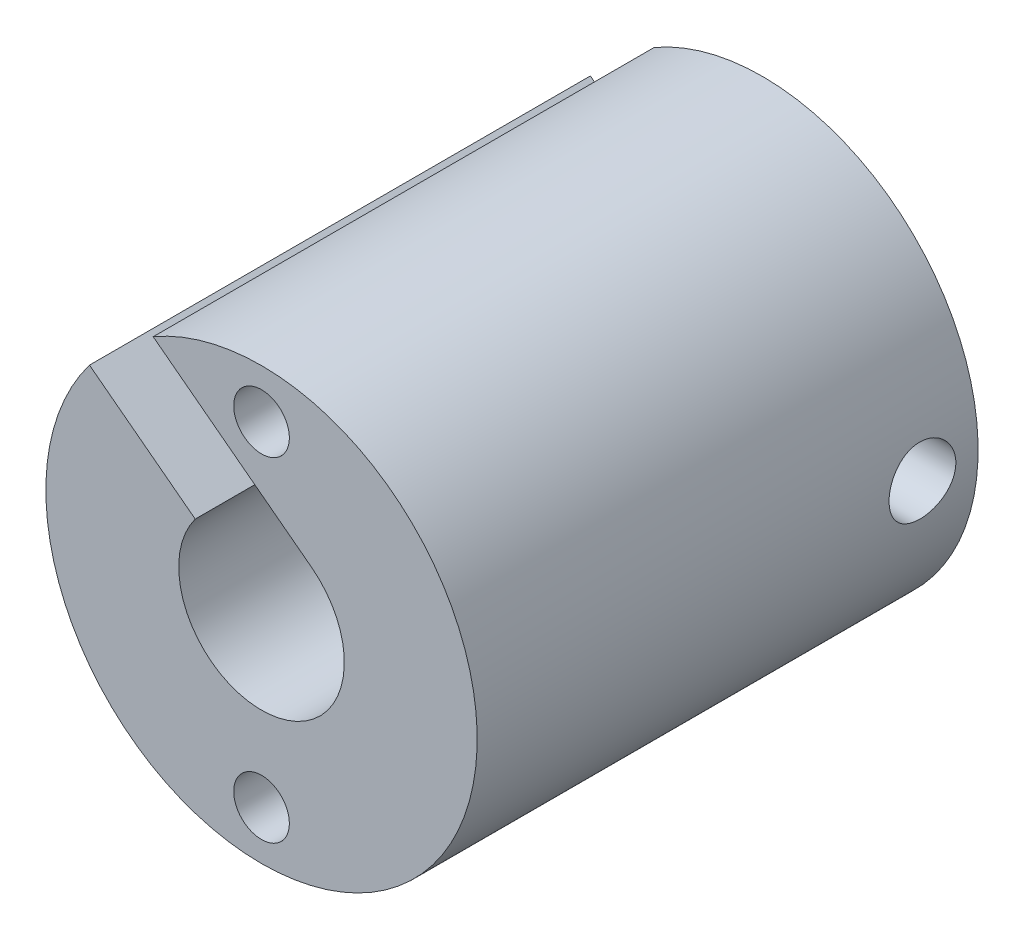
ISO-10303-21;
HEADER;
FILE_DESCRIPTION(('STEP AP214'),'2;1');
FILE_NAME('part.step','',(''),(''),'','','');
FILE_SCHEMA(('AUTOMOTIVE_DESIGN { 1 0 10303 214 1 1 1 1 }'));
ENDSEC;
DATA;
#1=APPLICATION_CONTEXT('core data for automotive mechanical design processes');
#2=APPLICATION_PROTOCOL_DEFINITION('international standard','automotive_design',2000,#1);
#3=PRODUCT_CONTEXT('',#1,'mechanical');
#4=PRODUCT('Part','Part','',(#3));
#5=PRODUCT_RELATED_PRODUCT_CATEGORY('part','',(#4));
#6=PRODUCT_DEFINITION_FORMATION('','',#4);
#7=PRODUCT_DEFINITION_CONTEXT('part definition',#1,'design');
#8=PRODUCT_DEFINITION('design','',#6,#7);
#9=PRODUCT_DEFINITION_SHAPE('','',#8);
#10=(LENGTH_UNIT() NAMED_UNIT(*) SI_UNIT(.MILLI.,.METRE.));
#11=(NAMED_UNIT(*) PLANE_ANGLE_UNIT() SI_UNIT($,.RADIAN.));
#12=(NAMED_UNIT(*) SI_UNIT($,.STERADIAN.) SOLID_ANGLE_UNIT());
#13=UNCERTAINTY_MEASURE_WITH_UNIT(LENGTH_MEASURE(1.E-05),#10,'distance_accuracy_value','');
#14=(GEOMETRIC_REPRESENTATION_CONTEXT(3) GLOBAL_UNCERTAINTY_ASSIGNED_CONTEXT((#13)) GLOBAL_UNIT_ASSIGNED_CONTEXT((#10,
#11,#12)) REPRESENTATION_CONTEXT('',''));
#15=CARTESIAN_POINT('',(0.,0.,0.));
#16=DIRECTION('',(0.,0.,1.));
#17=DIRECTION('',(1.,0.,0.));
#18=AXIS2_PLACEMENT_3D('',#15,#16,#17);
#19=CARTESIAN_POINT('',(0.,0.,18.));
#20=DIRECTION('',(0.,0.,-1.));
#21=DIRECTION('',(-1.,0.,0.));
#22=AXIS2_PLACEMENT_3D('',#19,#20,#21);
#23=CYLINDRICAL_SURFACE('',#22,2.975);
#24=CARTESIAN_POINT('',(-2.975,0.,3.2));
#25=CARTESIAN_POINT('',(-2.97499543849122,-0.0644527119775091,3.19999385413996));
#26=CARTESIAN_POINT('',(-2.97288096223465,-0.129015279752243,3.19477635476633));
#27=CARTESIAN_POINT('',(-2.96462844372845,-0.256318568293996,3.17408791318256));
#28=CARTESIAN_POINT('',(-2.95847954882213,-0.319053897009307,3.15858931338891));
#29=CARTESIAN_POINT('',(-2.94282045448793,-0.440655468210577,3.11799623089266));
#30=CARTESIAN_POINT('',(-2.93332134513576,-0.499533725193222,3.0929333861323));
#31=CARTESIAN_POINT('',(-2.91189528803918,-0.612195786829669,3.03404980370043));
#32=CARTESIAN_POINT('',(-2.89996916185444,-0.665981306401732,3.00023202857368));
#33=CARTESIAN_POINT('',(-2.87425599929314,-0.76957748673358,2.92309282469788));
#34=CARTESIAN_POINT('',(-2.8604105582516,-0.819113231125393,2.87942180106688));
#35=CARTESIAN_POINT('',(-2.83268306663957,-0.910391028104634,2.78455386581631));
#36=CARTESIAN_POINT('',(-2.81880100134134,-0.952129211188402,2.73335324007048));
#37=CARTESIAN_POINT('',(-2.79186996206152,-1.02849565515845,2.62205589091495));
#38=CARTESIAN_POINT('',(-2.77888748046482,-1.06271480038636,2.56166070202098));
#39=CARTESIAN_POINT('',(-2.75614374843864,-1.12038604250686,2.43537024792903));
#40=CARTESIAN_POINT('',(-2.74638094287695,-1.14384333961584,2.36947765735255));
#41=CARTESIAN_POINT('',(-2.73180997754027,-1.17820847725778,2.23722308431733));
#42=CARTESIAN_POINT('',(-2.72679485252911,-1.18964321331572,2.17102165548088));
#43=CARTESIAN_POINT('',(-2.72168809208222,-1.20128413773127,2.03746433213749));
#44=CARTESIAN_POINT('',(-2.72159397883171,-1.20149597701278,1.97010903571399));
#45=CARTESIAN_POINT('',(-2.72616359839092,-1.19108390567823,1.84125527563815));
#46=CARTESIAN_POINT('',(-2.73049008440479,-1.18122806989877,1.7796804478425));
#47=CARTESIAN_POINT('',(-2.74284660745854,-1.15224262138067,1.65914708892409));
#48=CARTESIAN_POINT('',(-2.75087730288875,-1.13311135998664,1.6001890249509));
#49=CARTESIAN_POINT('',(-2.76991482721115,-1.08575194255988,1.48512669561937));
#50=CARTESIAN_POINT('',(-2.78097953807692,-1.05734456705247,1.42910620107402));
#51=CARTESIAN_POINT('',(-2.80482295442844,-0.99236529364564,1.32241893360982));
#52=CARTESIAN_POINT('',(-2.81760230965147,-0.955790297248351,1.27175420324848));
#53=CARTESIAN_POINT('',(-2.84466016856605,-0.872130415296309,1.17301922481323));
#54=CARTESIAN_POINT('',(-2.85897749101233,-0.824444816398094,1.12546722939973));
#55=CARTESIAN_POINT('',(-2.88664402412407,-0.721625493753537,1.03886760606024));
#56=CARTESIAN_POINT('',(-2.89999303507381,-0.666490240179465,0.999821729226339));
#57=CARTESIAN_POINT('',(-2.92456354148567,-0.548845901752929,0.930646962195982));
#58=CARTESIAN_POINT('',(-2.93573609074813,-0.486209355852531,0.900716186793777));
#59=CARTESIAN_POINT('',(-2.95432368810416,-0.356225100487437,0.851995626741149));
#60=CARTESIAN_POINT('',(-2.96174067803455,-0.288879846234951,0.833200083688499));
#61=CARTESIAN_POINT('',(-2.97162579476467,-0.155731333869113,0.808338911550859));
#62=CARTESIAN_POINT('',(-2.9743642083898,-0.0900780894675279,0.801577006546156));
#63=CARTESIAN_POINT('',(-2.97543728704671,0.0414759594095336,0.798915161746905));
#64=CARTESIAN_POINT('',(-2.9737731174481,0.107376693762895,0.803012347537128));
#65=CARTESIAN_POINT('',(-2.96640464064649,0.234378330486649,0.821443032014926));
#66=CARTESIAN_POINT('',(-2.96088909177758,0.295560761342413,0.835298533027038));
#67=CARTESIAN_POINT('',(-2.94656947103641,0.414673939099446,0.87219919418572));
#68=CARTESIAN_POINT('',(-2.93776497795531,0.472604268416699,0.895245531410817));
#69=CARTESIAN_POINT('',(-2.91738380641617,0.585571463709733,0.950626382746522));
#70=CARTESIAN_POINT('',(-2.90573030783273,0.640464866393299,0.983224365920433));
#71=CARTESIAN_POINT('',(-2.88091068758872,0.744196100744338,1.05649146876159));
#72=CARTESIAN_POINT('',(-2.86774395507497,0.793031470283575,1.09716385270736));
#73=CARTESIAN_POINT('',(-2.84023398349683,0.886700071506095,1.18862499331149));
#74=CARTESIAN_POINT('',(-2.82587109109581,0.931044735884626,1.23990949968686));
#75=CARTESIAN_POINT('',(-2.79840050433673,1.01062182247356,1.34944136737322));
#76=CARTESIAN_POINT('',(-2.78529303180963,1.04585263614281,1.40768995515474));
#77=CARTESIAN_POINT('',(-2.76178494841692,1.10645452319749,1.53043700991597));
#78=CARTESIAN_POINT('',(-2.75141435029038,1.13171766764747,1.59499492394022));
#79=CARTESIAN_POINT('',(-2.73500923242151,1.17081490709715,1.72799417948904));
#80=CARTESIAN_POINT('',(-2.72897143909873,1.18465763179588,1.79643254692539));
#81=CARTESIAN_POINT('',(-2.72239415005224,1.1996900340859,1.92986734333339));
#82=CARTESIAN_POINT('',(-2.72148551167536,1.20172948342536,1.99475040756161));
#83=CARTESIAN_POINT('',(-2.72429959742431,1.19533633659155,2.12388961487603));
#84=CARTESIAN_POINT('',(-2.72802171074472,1.18690512152014,2.18814583951701));
#85=CARTESIAN_POINT('',(-2.73934989711425,1.16050804432101,2.31151206112791));
#86=CARTESIAN_POINT('',(-2.74679092289663,1.14294617234084,2.37072505121852));
#87=CARTESIAN_POINT('',(-2.76459963700392,1.09916758385867,2.48538586777053));
#88=CARTESIAN_POINT('',(-2.7749681364265,1.07294846840415,2.54083264546064));
#89=CARTESIAN_POINT('',(-2.79820830030691,1.01084794461784,2.64988353222506));
#90=CARTESIAN_POINT('',(-2.81119008670959,0.974495250483417,2.70319539921164));
#91=CARTESIAN_POINT('',(-2.83786414760872,0.893842582107171,2.80322875913718));
#92=CARTESIAN_POINT('',(-2.85155664187023,0.849540139113237,2.8499481967584));
#93=CARTESIAN_POINT('',(-2.87920209513429,0.75074566049415,2.93865554113822));
#94=CARTESIAN_POINT('',(-2.89311197831313,0.695772360789644,2.98012328293469));
#95=CARTESIAN_POINT('',(-2.91869874380594,0.579122193902362,3.05325908930909));
#96=CARTESIAN_POINT('',(-2.93037459209967,0.51744224316807,3.08492262019209));
#97=CARTESIAN_POINT('',(-2.949985457956,0.390228963102568,3.13681869640491));
#98=CARTESIAN_POINT('',(-2.95798488324745,0.324786549753689,3.15724939298633));
#99=CARTESIAN_POINT('',(-2.9696057567389,0.191129522551541,3.18664282997894));
#100=CARTESIAN_POINT('',(-2.9732410600885,0.122924396448249,3.19564186876941));
#101=CARTESIAN_POINT('',(-2.97483453061162,0.0363702112733114,3.1995884109585));
#102=CARTESIAN_POINT('',(-2.97500128732325,0.018189480365881,3.20000173444991));
#103=CARTESIAN_POINT('',(-2.975,0.,3.2));
#104=B_SPLINE_CURVE_WITH_KNOTS('',3,(#24,#25,#26,#27,#28,#29,#30,#31,#32,#33,#34,#35,#36,#37,
#38,#39,#40,#41,#42,#43,#44,#45,#46,#47,#48,#49,#50,#51,#52,#53,#54,#55,#56,#57,#58,#59,#60,#61,
#62,#63,#64,#65,#66,#67,#68,#69,#70,#71,#72,#73,#74,#75,#76,#77,#78,#79,#80,#81,#82,#83,#84,#85,
#86,#87,#88,#89,#90,#91,#92,#93,#94,#95,#96,#97,#98,#99,#100,#101,#102,#103),.UNSPECIFIED.,.T.,
.F.,(4,2,2,2,2,2,2,2,2,2,2,2,2,2,2,2,2,2,2,2,2,2,2,2,2,2,2,2,2,2,2,2,2,2,2,2,2,2,2,4),(0.,
0.193308895182854,0.387139938452418,0.580335281736046,0.773465335700886,0.975001776195977,
1.1766379640907,1.38743391226422,1.59812789448604,1.79914503300019,2.00006095492309,
2.18671548188243,2.37340319781721,2.56393537723301,2.7545399607814,2.96014990840093,
3.16580214351393,3.37564888068033,3.58538700411907,3.78253793589659,3.97963668678249,
4.16769753995862,4.35578248599337,4.54964266654468,4.74358138011192,4.95053608193494,
5.1575272851659,5.36670199957354,5.57571850854893,5.76947942327626,5.96321478326027,
6.14902789689213,6.33489254326157,6.53151135611131,6.72819133388798,6.93793099134064,
7.14776749293562,7.35377280989764,7.55912235982234,7.61367690447371),.UNSPECIFIED.);
#105=CARTESIAN_POINT('',(-2.975,0.,3.2));
#106=VERTEX_POINT('',#105);
#107=EDGE_CURVE('E43',#106,#106,#104,.T.);
#108=ORIENTED_EDGE('',*,*,#107,.F.);
#109=EDGE_LOOP('',(#108));
#110=FACE_BOUND('',#109,.T.);
#111=CARTESIAN_POINT('',(2.975,0.,0.8));
#112=CARTESIAN_POINT('',(2.97499543849122,-0.0644527119775091,0.800006145860041));
#113=CARTESIAN_POINT('',(2.97288096223465,-0.129015279752243,0.805223645233673));
#114=CARTESIAN_POINT('',(2.96462844372845,-0.256318568293995,0.82591208681744));
#115=CARTESIAN_POINT('',(2.95847954882213,-0.319053897009307,0.841410686611089));
#116=CARTESIAN_POINT('',(2.94282045448793,-0.440655468210577,0.882003769107338));
#117=CARTESIAN_POINT('',(2.93332134513576,-0.499533725193222,0.907066613867697));
#118=CARTESIAN_POINT('',(2.91189528803918,-0.612195786829669,0.96595019629957));
#119=CARTESIAN_POINT('',(2.89996916185444,-0.665981306401732,0.999767971426318));
#120=CARTESIAN_POINT('',(2.87425599929314,-0.76957748673358,1.07690717530212));
#121=CARTESIAN_POINT('',(2.8604105582516,-0.819113231125392,1.12057819893312));
#122=CARTESIAN_POINT('',(2.83268306663957,-0.910391028104634,1.21544613418369));
#123=CARTESIAN_POINT('',(2.81880100134134,-0.952129211188402,1.26664675992952));
#124=CARTESIAN_POINT('',(2.79186996206152,-1.02849565515845,1.37794410908505));
#125=CARTESIAN_POINT('',(2.77888748046482,-1.06271480038636,1.43833929797902));
#126=CARTESIAN_POINT('',(2.75614374843864,-1.12038604250686,1.56462975207097));
#127=CARTESIAN_POINT('',(2.74638094287695,-1.14384333961584,1.63052234264745));
#128=CARTESIAN_POINT('',(2.73180997754027,-1.17820847725778,1.76277691568267));
#129=CARTESIAN_POINT('',(2.72679485252911,-1.18964321331572,1.82897834451912));
#130=CARTESIAN_POINT('',(2.72168809208222,-1.20128413773127,1.96253566786251));
#131=CARTESIAN_POINT('',(2.72159397883171,-1.20149597701278,2.02989096428601));
#132=CARTESIAN_POINT('',(2.72616359839092,-1.19108390567823,2.15874472436185));
#133=CARTESIAN_POINT('',(2.73049008440479,-1.18122806989877,2.2203195521575));
#134=CARTESIAN_POINT('',(2.74284660745854,-1.15224262138067,2.34085291107591));
#135=CARTESIAN_POINT('',(2.75087730288875,-1.13311135998664,2.3998109750491));
#136=CARTESIAN_POINT('',(2.76991482721115,-1.08575194255988,2.51487330438063));
#137=CARTESIAN_POINT('',(2.78097953807691,-1.05734456705246,2.57089379892598));
#138=CARTESIAN_POINT('',(2.80482295442844,-0.992365293645639,2.67758106639018));
#139=CARTESIAN_POINT('',(2.81760230965147,-0.955790297248351,2.72824579675152));
#140=CARTESIAN_POINT('',(2.84466016856605,-0.872130415296309,2.82698077518677));
#141=CARTESIAN_POINT('',(2.85897749101233,-0.824444816398093,2.87453277060027));
#142=CARTESIAN_POINT('',(2.88664402412407,-0.721625493753536,2.96113239393977));
#143=CARTESIAN_POINT('',(2.89999303507381,-0.666490240179465,3.00017827077366));
#144=CARTESIAN_POINT('',(2.92456354148567,-0.548845901752929,3.06935303780402));
#145=CARTESIAN_POINT('',(2.93573609074813,-0.486209355852531,3.09928381320622));
#146=CARTESIAN_POINT('',(2.95432368810416,-0.356225100487437,3.14800437325885));
#147=CARTESIAN_POINT('',(2.96174067803455,-0.288879846234951,3.1667999163115));
#148=CARTESIAN_POINT('',(2.97162579476467,-0.155731333869113,3.19166108844914));
#149=CARTESIAN_POINT('',(2.9743642083898,-0.0900780894675278,3.19842299345384));
#150=CARTESIAN_POINT('',(2.97543728704671,0.0414759594095337,3.20108483825309));
#151=CARTESIAN_POINT('',(2.9737731174481,0.107376693762895,3.19698765246287));
#152=CARTESIAN_POINT('',(2.96640464064649,0.234378330486649,3.17855696798507));
#153=CARTESIAN_POINT('',(2.96088909177758,0.295560761342413,3.16470146697296));
#154=CARTESIAN_POINT('',(2.94656947103641,0.414673939099447,3.12780080581428));
#155=CARTESIAN_POINT('',(2.93776497795531,0.472604268416699,3.10475446858918));
#156=CARTESIAN_POINT('',(2.91738380641617,0.585571463709733,3.04937361725348));
#157=CARTESIAN_POINT('',(2.90573030783273,0.640464866393299,3.01677563407957));
#158=CARTESIAN_POINT('',(2.88091068758872,0.744196100744338,2.94350853123841));
#159=CARTESIAN_POINT('',(2.86774395507497,0.793031470283575,2.90283614729264));
#160=CARTESIAN_POINT('',(2.84023398349683,0.886700071506095,2.81137500668851));
#161=CARTESIAN_POINT('',(2.82587109109581,0.931044735884626,2.76009050031314));
#162=CARTESIAN_POINT('',(2.79840050433673,1.01062182247356,2.65055863262678));
#163=CARTESIAN_POINT('',(2.78529303180963,1.04585263614281,2.59231004484526));
#164=CARTESIAN_POINT('',(2.76178494841692,1.10645452319749,2.46956299008403));
#165=CARTESIAN_POINT('',(2.75141435029038,1.13171766764747,2.40500507605978));
#166=CARTESIAN_POINT('',(2.73500923242151,1.17081490709715,2.27200582051096));
#167=CARTESIAN_POINT('',(2.72897143909873,1.18465763179588,2.20356745307461));
#168=CARTESIAN_POINT('',(2.72239415005224,1.1996900340859,2.07013265666661));
#169=CARTESIAN_POINT('',(2.72148551167536,1.20172948342536,2.00524959243839));
#170=CARTESIAN_POINT('',(2.72429959742431,1.19533633659155,1.87611038512397));
#171=CARTESIAN_POINT('',(2.72802171074472,1.18690512152014,1.81185416048299));
#172=CARTESIAN_POINT('',(2.73934989711425,1.160508044321,1.68848793887209));
#173=CARTESIAN_POINT('',(2.74679092289663,1.14294617234084,1.62927494878148));
#174=CARTESIAN_POINT('',(2.76459963700391,1.09916758385867,1.51461413222948));
#175=CARTESIAN_POINT('',(2.7749681364265,1.07294846840415,1.45916735453936));
#176=CARTESIAN_POINT('',(2.79820830030691,1.01084794461784,1.35011646777494));
#177=CARTESIAN_POINT('',(2.81119008670959,0.974495250483417,1.29680460078836));
#178=CARTESIAN_POINT('',(2.83786414760872,0.893842582107172,1.19677124086282));
#179=CARTESIAN_POINT('',(2.85155664187023,0.849540139113237,1.1500518032416));
#180=CARTESIAN_POINT('',(2.87920209513429,0.75074566049415,1.06134445886178));
#181=CARTESIAN_POINT('',(2.89311197831313,0.695772360789644,1.01987671706531));
#182=CARTESIAN_POINT('',(2.91869874380594,0.579122193902362,0.946740910690915));
#183=CARTESIAN_POINT('',(2.93037459209967,0.517442243168071,0.915077379807911));
#184=CARTESIAN_POINT('',(2.949985457956,0.390228963102569,0.863181303595089));
#185=CARTESIAN_POINT('',(2.95798488324745,0.32478654975369,0.842750607013667));
#186=CARTESIAN_POINT('',(2.9696057567389,0.191129522551541,0.813357170021057));
#187=CARTESIAN_POINT('',(2.9732410600885,0.122924396448249,0.804358131230596));
#188=CARTESIAN_POINT('',(2.97483453061162,0.0363702112733115,0.800411589041497));
#189=CARTESIAN_POINT('',(2.97500128732325,0.0181894803658809,0.799998265550089));
#190=CARTESIAN_POINT('',(2.975,0.,0.8));
#191=B_SPLINE_CURVE_WITH_KNOTS('',3,(#111,#112,#113,#114,#115,#116,#117,#118,#119,#120,#121,
#122,#123,#124,#125,#126,#127,#128,#129,#130,#131,#132,#133,#134,#135,#136,#137,#138,#139,#140,
#141,#142,#143,#144,#145,#146,#147,#148,#149,#150,#151,#152,#153,#154,#155,#156,#157,#158,#159,
#160,#161,#162,#163,#164,#165,#166,#167,#168,#169,#170,#171,#172,#173,#174,#175,#176,#177,#178,
#179,#180,#181,#182,#183,#184,#185,#186,#187,#188,#189,#190),.UNSPECIFIED.,.T.,.F.,(4,2,2,2,2,2,
2,2,2,2,2,2,2,2,2,2,2,2,2,2,2,2,2,2,2,2,2,2,2,2,2,2,2,2,2,2,2,2,2,4),(0.,0.193308895182854,
0.387139938452418,0.580335281736046,0.773465335700886,0.975001776195976,1.1766379640907,
1.38743391226422,1.59812789448604,1.79914503300019,2.00006095492309,2.18671548188243,
2.37340319781721,2.56393537723301,2.7545399607814,2.96014990840093,3.16580214351393,
3.37564888068033,3.58538700411907,3.78253793589659,3.97963668678249,4.16769753995862,
4.35578248599337,4.54964266654468,4.74358138011193,4.95053608193494,5.1575272851659,
5.36670199957354,5.57571850854893,5.76947942327626,5.96321478326027,6.14902789689213,
6.33489254326157,6.53151135611131,6.72819133388798,6.93793099134064,7.14776749293562,
7.35377280989764,7.55912235982234,7.61367690447371),.UNSPECIFIED.);
#192=CARTESIAN_POINT('',(2.975,0.,0.8));
#193=VERTEX_POINT('',#192);
#194=EDGE_CURVE('E108',#193,#193,#191,.T.);
#195=ORIENTED_EDGE('',*,*,#194,.F.);
#196=EDGE_LOOP('',(#195));
#197=FACE_BOUND('',#196,.T.);
#198=CARTESIAN_POINT('',(0.,0.,18.));
#199=DIRECTION('',(0.,0.,1.));
#200=DIRECTION('',(1.,0.,0.));
#201=AXIS2_PLACEMENT_3D('',#198,#199,#200);
#202=CIRCLE('',#201,2.975);
#203=CARTESIAN_POINT('',(-2.38265846263205,1.78144987312242,18.));
#204=VERTEX_POINT('',#203);
#205=CARTESIAN_POINT('',(1.80140931217271,2.36760416666669,18.));
#206=VERTEX_POINT('',#205);
#207=EDGE_CURVE('E102',#204,#206,#202,.T.);
#208=ORIENTED_EDGE('',*,*,#207,.T.);
#209=DIRECTION('',(0.,0.,-1.));
#210=VECTOR('',#209,1.);
#211=CARTESIAN_POINT('',(1.80140931217271,2.36760416666669,18.));
#212=LINE('',#211,#210);
#213=CARTESIAN_POINT('',(1.80140931217271,2.36760416666669,0.));
#214=VERTEX_POINT('',#213);
#215=EDGE_CURVE('E106',#206,#214,#212,.T.);
#216=ORIENTED_EDGE('',*,*,#215,.T.);
#217=CARTESIAN_POINT('',(0.,0.,0.));
#218=DIRECTION('',(0.,0.,1.));
#219=DIRECTION('',(1.,0.,0.));
#220=AXIS2_PLACEMENT_3D('',#217,#218,#219);
#221=CIRCLE('',#220,2.975);
#222=CARTESIAN_POINT('',(-2.38265846263205,1.78144987312242,0.));
#223=VERTEX_POINT('',#222);
#224=EDGE_CURVE('E159',#223,#214,#221,.T.);
#225=ORIENTED_EDGE('',*,*,#224,.F.);
#226=DIRECTION('',(0.,0.,-1.));
#227=VECTOR('',#226,1.);
#228=CARTESIAN_POINT('',(-2.38265846263205,1.78144987312242,18.));
#229=LINE('',#228,#227);
#230=EDGE_CURVE('E94',#204,#223,#229,.T.);
#231=ORIENTED_EDGE('',*,*,#230,.F.);
#232=EDGE_LOOP('',(#208,#216,#225,#231));
#233=FACE_BOUND('',#232,.T.);
#234=ADVANCED_FACE('F38',(#110,#197,#233),#23,.F.);
#235=CARTESIAN_POINT('',(0.,0.,18.));
#236=DIRECTION('',(0.,0.,1.));
#237=DIRECTION('',(1.,0.,0.));
#238=AXIS2_PLACEMENT_3D('',#235,#236,#237);
#239=PLANE('',#238);
#240=DIRECTION('',(0.79583333333334,-0.605515735184103,0.));
#241=VECTOR('',#240,1.);
#242=CARTESIAN_POINT('',(1.80140931217271,2.36760416666669,18.));
#243=LINE('',#242,#241);
#244=CARTESIAN_POINT('',(-3.89377080745939,6.70082449396916,18.));
#245=VERTEX_POINT('',#244);
#246=EDGE_CURVE('E103',#245,#206,#243,.T.);
#247=ORIENTED_EDGE('',*,*,#246,.T.);
#248=ORIENTED_EDGE('',*,*,#207,.F.);
#249=DIRECTION('',(-0.79583333333334,0.605515735184103,0.));
#250=VECTOR('',#249,1.);
#251=CARTESIAN_POINT('',(-6.18281413657574,4.67282669832288,18.));
#252=LINE('',#251,#250);
#253=CARTESIAN_POINT('',(-6.18281413657574,4.67282669832288,18.));
#254=VERTEX_POINT('',#253);
#255=EDGE_CURVE('E69',#204,#254,#252,.T.);
#256=ORIENTED_EDGE('',*,*,#255,.T.);
#257=CARTESIAN_POINT('',(0.,0.,18.));
#258=DIRECTION('',(0.,0.,1.));
#259=DIRECTION('',(1.,0.,0.));
#260=AXIS2_PLACEMENT_3D('',#257,#258,#259);
#261=CIRCLE('',#260,7.75);
#262=EDGE_CURVE('E11',#254,#245,#261,.T.);
#263=ORIENTED_EDGE('',*,*,#262,.T.);
#264=EDGE_LOOP('',(#247,#248,#256,#263));
#265=FACE_BOUND('',#264,.T.);
#266=CARTESIAN_POINT('',(0.,6.,18.));
#267=DIRECTION('',(0.,0.,1.));
#268=DIRECTION('',(1.,0.,0.));
#269=AXIS2_PLACEMENT_3D('',#266,#267,#268);
#270=CIRCLE('',#269,1.);
#271=CARTESIAN_POINT('',(0.999999999999933,6.,18.));
#272=VERTEX_POINT('',#271);
#273=EDGE_CURVE('E173',#272,#272,#270,.T.);
#274=ORIENTED_EDGE('',*,*,#273,.F.);
#275=EDGE_LOOP('',(#274));
#276=FACE_BOUND('',#275,.T.);
#277=CARTESIAN_POINT('',(0.,-6.,18.));
#278=DIRECTION('',(0.,0.,1.));
#279=DIRECTION('',(1.,0.,0.));
#280=AXIS2_PLACEMENT_3D('',#277,#278,#279);
#281=CIRCLE('',#280,1.);
#282=CARTESIAN_POINT('',(1.,-6.,18.));
#283=VERTEX_POINT('',#282);
#284=EDGE_CURVE('E168',#283,#283,#281,.T.);
#285=ORIENTED_EDGE('',*,*,#284,.F.);
#286=EDGE_LOOP('',(#285));
#287=FACE_BOUND('',#286,.T.);
#288=ADVANCED_FACE('F99',(#265,#276,#287),#239,.T.);
#289=CARTESIAN_POINT('',(0.,0.,0.));
#290=DIRECTION('',(0.,0.,1.));
#291=DIRECTION('',(1.,0.,0.));
#292=AXIS2_PLACEMENT_3D('',#289,#290,#291);
#293=PLANE('',#292);
#294=ORIENTED_EDGE('',*,*,#224,.T.);
#295=DIRECTION('',(0.79583333333334,-0.605515735184103,0.));
#296=VECTOR('',#295,1.);
#297=CARTESIAN_POINT('',(1.80140931217271,2.36760416666669,0.));
#298=LINE('',#297,#296);
#299=CARTESIAN_POINT('',(-3.89377080745939,6.70082449396916,0.));
#300=VERTEX_POINT('',#299);
#301=EDGE_CURVE('E61',#300,#214,#298,.T.);
#302=ORIENTED_EDGE('',*,*,#301,.F.);
#303=CARTESIAN_POINT('',(0.,0.,0.));
#304=DIRECTION('',(0.,0.,1.));
#305=DIRECTION('',(1.,0.,0.));
#306=AXIS2_PLACEMENT_3D('',#303,#304,#305);
#307=CIRCLE('',#306,7.75);
#308=CARTESIAN_POINT('',(-6.18281413657574,4.67282669832288,0.));
#309=VERTEX_POINT('',#308);
#310=EDGE_CURVE('E53',#309,#300,#307,.T.);
#311=ORIENTED_EDGE('',*,*,#310,.F.);
#312=DIRECTION('',(-0.79583333333334,0.605515735184103,0.));
#313=VECTOR('',#312,1.);
#314=CARTESIAN_POINT('',(-6.18281413657574,4.67282669832288,0.));
#315=LINE('',#314,#313);
#316=EDGE_CURVE('E88',#223,#309,#315,.T.);
#317=ORIENTED_EDGE('',*,*,#316,.F.);
#318=EDGE_LOOP('',(#294,#302,#311,#317));
#319=FACE_BOUND('',#318,.T.);
#320=CARTESIAN_POINT('',(0.,6.,0.));
#321=DIRECTION('',(0.,0.,1.));
#322=DIRECTION('',(1.,0.,0.));
#323=AXIS2_PLACEMENT_3D('',#320,#321,#322);
#324=CIRCLE('',#323,1.);
#325=CARTESIAN_POINT('',(0.999999999999933,6.,0.));
#326=VERTEX_POINT('',#325);
#327=EDGE_CURVE('E163',#326,#326,#324,.T.);
#328=ORIENTED_EDGE('',*,*,#327,.T.);
#329=EDGE_LOOP('',(#328));
#330=FACE_BOUND('',#329,.T.);
#331=CARTESIAN_POINT('',(0.,-6.,0.));
#332=DIRECTION('',(0.,0.,1.));
#333=DIRECTION('',(1.,0.,0.));
#334=AXIS2_PLACEMENT_3D('',#331,#332,#333);
#335=CIRCLE('',#334,1.);
#336=CARTESIAN_POINT('',(1.,-6.,0.));
#337=VERTEX_POINT('',#336);
#338=EDGE_CURVE('E166',#337,#337,#335,.T.);
#339=ORIENTED_EDGE('',*,*,#338,.T.);
#340=EDGE_LOOP('',(#339));
#341=FACE_BOUND('',#340,.T.);
#342=ADVANCED_FACE('F149',(#319,#330,#341),#293,.F.);
#343=CARTESIAN_POINT('',(0.,0.,18.));
#344=DIRECTION('',(0.,0.,-1.));
#345=DIRECTION('',(-1.,0.,0.));
#346=AXIS2_PLACEMENT_3D('',#343,#344,#345);
#347=CYLINDRICAL_SURFACE('',#346,7.75);
#348=CARTESIAN_POINT('',(-7.75,0.,0.8));
#349=CARTESIAN_POINT('',(-7.74999890333329,0.0669750385211258,0.80000274169157));
#350=CARTESIAN_POINT('',(-7.7491227253236,0.133988294408655,0.805626002518227));
#351=CARTESIAN_POINT('',(-7.7457118156786,0.266139896457631,0.827963753391723));
#352=CARTESIAN_POINT('',(-7.74317549426818,0.331276382915999,0.844688874942897));
#353=CARTESIAN_POINT('',(-7.73672917128382,0.457742974275891,0.888717103476646));
#354=CARTESIAN_POINT('',(-7.73282023220025,0.519075980222486,0.916012030455655));
#355=CARTESIAN_POINT('',(-7.72406001094022,0.636282469794899,0.980384667644744));
#356=CARTESIAN_POINT('',(-7.7192088531617,0.692156672665969,1.0174610866688));
#357=CARTESIAN_POINT('',(-7.70905815170804,0.797332315303886,1.10067207516072));
#358=CARTESIAN_POINT('',(-7.70375554580414,0.846581863844081,1.14687186663659));
#359=CARTESIAN_POINT('',(-7.69332340346129,0.936662324227974,1.24687778994085));
#360=CARTESIAN_POINT('',(-7.68819387725496,0.977492739051969,1.30068437051667));
#361=CARTESIAN_POINT('',(-7.67865898687595,1.04977960107217,1.41472737665656));
#362=CARTESIAN_POINT('',(-7.67425758036342,1.08118552778661,1.47499618458376));
#363=CARTESIAN_POINT('',(-7.66671928171394,1.13340900011903,1.60003296341579));
#364=CARTESIAN_POINT('',(-7.66358231608433,1.15422716114457,1.66480067257591));
#365=CARTESIAN_POINT('',(-7.65895829576881,1.18452232833442,1.79644973989314));
#366=CARTESIAN_POINT('',(-7.65745829216373,1.19408839004862,1.86331014132676));
#367=CARTESIAN_POINT('',(-7.65623876136374,1.20188376430119,1.99770268068324));
#368=CARTESIAN_POINT('',(-7.65651912531837,1.20011376991833,2.06523477728707));
#369=CARTESIAN_POINT('',(-7.65881681607365,1.18535998619418,2.19842277358281));
#370=CARTESIAN_POINT('',(-7.66081874207688,1.17247562093345,2.26408999095944));
#371=CARTESIAN_POINT('',(-7.66630991868688,1.13601458342391,2.39231916224553));
#372=CARTESIAN_POINT('',(-7.66979921388522,1.11243759060701,2.45488102299311));
#373=CARTESIAN_POINT('',(-7.67788887996858,1.05515788658906,2.57542472131519));
#374=CARTESIAN_POINT('',(-7.68249383066355,1.02141329413514,2.63338633788922));
#375=CARTESIAN_POINT('',(-7.69229267310673,0.944786076713645,2.7428621985916));
#376=CARTESIAN_POINT('',(-7.69748660598868,0.901902813329281,2.79437599188332));
#377=CARTESIAN_POINT('',(-7.70794612924501,0.807670929189281,2.8900699462714));
#378=CARTESIAN_POINT('',(-7.71321189293593,0.756236875812466,2.93416600448398));
#379=CARTESIAN_POINT('',(-7.72317036579355,0.646653983813877,3.01311344027419));
#380=CARTESIAN_POINT('',(-7.72786307214402,0.588505112195442,3.04796477242041));
#381=CARTESIAN_POINT('',(-7.73615206482833,0.467068589253492,3.10743870772051));
#382=CARTESIAN_POINT('',(-7.73974762699592,0.403777578620877,3.13205455885052));
#383=CARTESIAN_POINT('',(-7.74543122738928,0.273891845907985,3.17028428484067));
#384=CARTESIAN_POINT('',(-7.74751937427969,0.207297362334243,3.1838989527487));
#385=CARTESIAN_POINT('',(-7.74993841326686,0.0734206490968181,3.19962739875632));
#386=CARTESIAN_POINT('',(-7.75028696387225,0.00615230541897577,3.2018567537144));
#387=CARTESIAN_POINT('',(-7.74923568939721,-0.127797366163604,3.19505844695774));
#388=CARTESIAN_POINT('',(-7.74783592210102,-0.194478713396004,3.18603115729013));
#389=CARTESIAN_POINT('',(-7.74345621392855,-0.325009534009669,3.15707192946776));
#390=CARTESIAN_POINT('',(-7.74048447205231,-0.388871855228832,3.13719655507018));
#391=CARTESIAN_POINT('',(-7.73329286635225,-0.512357795134212,3.08716517750938));
#392=CARTESIAN_POINT('',(-7.72907294062321,-0.571981203404323,3.05700866442901));
#393=CARTESIAN_POINT('',(-7.71980981371281,-0.685803317725341,2.98700169830025));
#394=CARTESIAN_POINT('',(-7.71476051144762,-0.73995661757551,2.94707824307253));
#395=CARTESIAN_POINT('',(-7.70441894107151,-0.84083590944528,2.85877196848455));
#396=CARTESIAN_POINT('',(-7.69912665787651,-0.887561439548633,2.81038862341542));
#397=CARTESIAN_POINT('',(-7.6888392938559,-0.972681582423202,2.70602037318252));
#398=CARTESIAN_POINT('',(-7.68384726899065,-1.01099854423003,2.64997179030689));
#399=CARTESIAN_POINT('',(-7.67478058194127,-1.07767341207768,2.53216587467046));
#400=CARTESIAN_POINT('',(-7.67070589371639,-1.10603160083434,2.47040870403149));
#401=CARTESIAN_POINT('',(-7.66395758467662,-1.1518647616933,2.3431661740645));
#402=CARTESIAN_POINT('',(-7.6612787890881,-1.16937997633771,2.27769559685915));
#403=CARTESIAN_POINT('',(-7.65761202486225,-1.19315769340082,2.14469729983287));
#404=CARTESIAN_POINT('',(-7.65662393109819,-1.19942102855871,2.0771697326237));
#405=CARTESIAN_POINT('',(-7.65645532284877,-1.20049642286999,1.94274866690325));
#406=CARTESIAN_POINT('',(-7.65725553052942,-1.19543060947175,1.87585613777809));
#407=CARTESIAN_POINT('',(-7.66053136643427,-1.17425388174132,1.74388682795977));
#408=CARTESIAN_POINT('',(-7.66300699125215,-1.1581429898651,1.67881004357526));
#409=CARTESIAN_POINT('',(-7.66934781607214,-1.11537764319969,1.55235711794452));
#410=CARTESIAN_POINT('',(-7.67321181741192,-1.08873228141701,1.49097783765012));
#411=CARTESIAN_POINT('',(-7.68189538969954,-1.025666608068,1.3735410589454));
#412=CARTESIAN_POINT('',(-7.6867149972584,-0.989245921972201,1.31748376455183));
#413=CARTESIAN_POINT('',(-7.69682847641995,-0.907221919439192,1.2116626761366));
#414=CARTESIAN_POINT('',(-7.70212670264064,-0.861528312621443,1.16196927548545));
#415=CARTESIAN_POINT('',(-7.71256454656094,-0.762446345251096,1.07091264395899));
#416=CARTESIAN_POINT('',(-7.71770412719453,-0.709056202752568,1.02955134751136));
#417=CARTESIAN_POINT('',(-7.72728031099258,-0.595725688198968,0.956113926495537));
#418=CARTESIAN_POINT('',(-7.73171259726287,-0.535748602600012,0.924093901593126));
#419=CARTESIAN_POINT('',(-7.73933258882611,-0.411225992372962,0.870630802424858));
#420=CARTESIAN_POINT('',(-7.74252156865113,-0.346685226673383,0.849176890705849));
#421=CARTESIAN_POINT('',(-7.74657661818046,-0.234887903580453,0.82226348572233));
#422=CARTESIAN_POINT('',(-7.7478537185164,-0.188317750241239,0.813927607184099));
#423=CARTESIAN_POINT('',(-7.74956579060494,-0.0945047353905921,0.802794934855286));
#424=CARTESIAN_POINT('',(-7.75000077387837,-0.0472618830911317,0.799998065286571));
#425=CARTESIAN_POINT('',(-7.75,0.,0.8));
#426=B_SPLINE_CURVE_WITH_KNOTS('',3,(#348,#349,#350,#351,#352,#353,#354,#355,#356,#357,#358,
#359,#360,#361,#362,#363,#364,#365,#366,#367,#368,#369,#370,#371,#372,#373,#374,#375,#376,#377,
#378,#379,#380,#381,#382,#383,#384,#385,#386,#387,#388,#389,#390,#391,#392,#393,#394,#395,#396,
#397,#398,#399,#400,#401,#402,#403,#404,#405,#406,#407,#408,#409,#410,#411,#412,#413,#414,#415,
#416,#417,#418,#419,#420,#421,#422,#423,#424,#425),.UNSPECIFIED.,.T.,.F.,(4,2,2,2,2,2,2,2,2,2,2,
2,2,2,2,2,2,2,2,2,2,2,2,2,2,2,2,2,2,2,2,2,2,2,2,2,2,2,4),(0.,0.200752400123545,
0.401697325188974,0.602487048175609,0.803250279572186,1.00550439712177,1.20777045123428,
1.41110215229941,1.61442203347966,1.816121659574,2.01780895400801,2.2177105381162,
2.4176181157284,2.61836065660917,2.81911722572726,3.02201558746338,3.22491494628586,
3.42794793988036,3.63096629602629,3.8319195763796,4.03286621513454,4.23277495674024,
4.43269361473079,4.6341548268133,4.83562856241722,5.0388911187811,5.24214790433464,
5.44464572900477,5.64712856641665,5.84743918572399,6.04774939777686,6.24788708484015,
6.44803244102645,6.65022916535345,6.85247277883288,7.05590709173424,7.25913230926763,
7.40079801756351,7.54246178774425),.UNSPECIFIED.);
#427=CARTESIAN_POINT('',(-7.75,0.,0.8));
#428=VERTEX_POINT('',#427);
#429=EDGE_CURVE('E119',#428,#428,#426,.T.);
#430=ORIENTED_EDGE('',*,*,#429,.T.);
#431=EDGE_LOOP('',(#430));
#432=FACE_BOUND('',#431,.T.);
#433=CARTESIAN_POINT('',(7.75,0.,0.8));
#434=CARTESIAN_POINT('',(7.74999890333329,-0.0669750385211261,0.80000274169157));
#435=CARTESIAN_POINT('',(7.7491227253236,-0.133988294408656,0.805626002518227));
#436=CARTESIAN_POINT('',(7.7457118156786,-0.266139896457631,0.827963753391723));
#437=CARTESIAN_POINT('',(7.74317549426818,-0.331276382915999,0.844688874942897));
#438=CARTESIAN_POINT('',(7.73672917128382,-0.457742974275891,0.888717103476645));
#439=CARTESIAN_POINT('',(7.73282023220025,-0.519075980222486,0.916012030455655));
#440=CARTESIAN_POINT('',(7.72406001094022,-0.636282469794899,0.980384667644744));
#441=CARTESIAN_POINT('',(7.7192088531617,-0.692156672665969,1.0174610866688));
#442=CARTESIAN_POINT('',(7.70905815170804,-0.797332315303887,1.10067207516072));
#443=CARTESIAN_POINT('',(7.70375554580414,-0.846581863844082,1.14687186663659));
#444=CARTESIAN_POINT('',(7.69332340346129,-0.936662324227974,1.24687778994085));
#445=CARTESIAN_POINT('',(7.68819387725495,-0.977492739051969,1.30068437051667));
#446=CARTESIAN_POINT('',(7.67865898687595,-1.04977960107217,1.41472737665656));
#447=CARTESIAN_POINT('',(7.67425758036342,-1.08118552778661,1.47499618458376));
#448=CARTESIAN_POINT('',(7.66671928171394,-1.13340900011903,1.60003296341579));
#449=CARTESIAN_POINT('',(7.66358231608433,-1.15422716114457,1.66480067257591));
#450=CARTESIAN_POINT('',(7.65895829576881,-1.18452232833442,1.79644973989314));
#451=CARTESIAN_POINT('',(7.65745829216373,-1.19408839004862,1.86331014132676));
#452=CARTESIAN_POINT('',(7.65623876136374,-1.20188376430119,1.99770268068324));
#453=CARTESIAN_POINT('',(7.65651912531837,-1.20011376991833,2.06523477728707));
#454=CARTESIAN_POINT('',(7.65881681607365,-1.18535998619418,2.19842277358281));
#455=CARTESIAN_POINT('',(7.66081874207688,-1.17247562093345,2.26408999095944));
#456=CARTESIAN_POINT('',(7.66630991868688,-1.13601458342391,2.39231916224553));
#457=CARTESIAN_POINT('',(7.66979921388522,-1.11243759060701,2.45488102299311));
#458=CARTESIAN_POINT('',(7.67788887996858,-1.05515788658906,2.57542472131519));
#459=CARTESIAN_POINT('',(7.68249383066355,-1.02141329413514,2.63338633788922));
#460=CARTESIAN_POINT('',(7.69229267310673,-0.944786076713646,2.7428621985916));
#461=CARTESIAN_POINT('',(7.69748660598868,-0.901902813329282,2.79437599188332));
#462=CARTESIAN_POINT('',(7.70794612924501,-0.807670929189282,2.8900699462714));
#463=CARTESIAN_POINT('',(7.71321189293593,-0.756236875812467,2.93416600448398));
#464=CARTESIAN_POINT('',(7.72317036579355,-0.646653983813879,3.01311344027419));
#465=CARTESIAN_POINT('',(7.72786307214402,-0.588505112195443,3.04796477242041));
#466=CARTESIAN_POINT('',(7.73615206482833,-0.467068589253494,3.10743870772051));
#467=CARTESIAN_POINT('',(7.73974762699592,-0.403777578620879,3.13205455885052));
#468=CARTESIAN_POINT('',(7.74543122738928,-0.273891845907987,3.17028428484067));
#469=CARTESIAN_POINT('',(7.74751937427969,-0.207297362334245,3.1838989527487));
#470=CARTESIAN_POINT('',(7.74993841326686,-0.0734206490968196,3.19962739875632));
#471=CARTESIAN_POINT('',(7.75028696387225,-0.00615230541897735,3.2018567537144));
#472=CARTESIAN_POINT('',(7.74923568939721,0.127797366163603,3.19505844695774));
#473=CARTESIAN_POINT('',(7.74783592210102,0.194478713396002,3.18603115729013));
#474=CARTESIAN_POINT('',(7.74345621392855,0.325009534009667,3.15707192946776));
#475=CARTESIAN_POINT('',(7.74048447205231,0.38887185522883,3.13719655507018));
#476=CARTESIAN_POINT('',(7.73329286635225,0.51235779513421,3.08716517750938));
#477=CARTESIAN_POINT('',(7.72907294062321,0.571981203404321,3.05700866442901));
#478=CARTESIAN_POINT('',(7.71980981371281,0.68580331772534,2.98700169830025));
#479=CARTESIAN_POINT('',(7.71476051144762,0.739956617575509,2.94707824307253));
#480=CARTESIAN_POINT('',(7.70441894107151,0.840835909445279,2.85877196848455));
#481=CARTESIAN_POINT('',(7.69912665787651,0.887561439548632,2.81038862341542));
#482=CARTESIAN_POINT('',(7.6888392938559,0.972681582423201,2.70602037318253));
#483=CARTESIAN_POINT('',(7.68384726899066,1.01099854423003,2.64997179030689));
#484=CARTESIAN_POINT('',(7.67478058194127,1.07767341207768,2.53216587467047));
#485=CARTESIAN_POINT('',(7.67070589371639,1.10603160083433,2.4704087040315));
#486=CARTESIAN_POINT('',(7.66395758467662,1.1518647616933,2.3431661740645));
#487=CARTESIAN_POINT('',(7.6612787890881,1.16937997633771,2.27769559685915));
#488=CARTESIAN_POINT('',(7.65761202486225,1.19315769340082,2.14469729983287));
#489=CARTESIAN_POINT('',(7.65662393109819,1.19942102855871,2.0771697326237));
#490=CARTESIAN_POINT('',(7.65645532284877,1.20049642286999,1.94274866690325));
#491=CARTESIAN_POINT('',(7.65725553052942,1.19543060947175,1.87585613777809));
#492=CARTESIAN_POINT('',(7.66053136643427,1.17425388174132,1.74388682795977));
#493=CARTESIAN_POINT('',(7.66300699125215,1.1581429898651,1.67881004357526));
#494=CARTESIAN_POINT('',(7.66934781607214,1.11537764319969,1.55235711794452));
#495=CARTESIAN_POINT('',(7.67321181741192,1.08873228141701,1.49097783765012));
#496=CARTESIAN_POINT('',(7.68189538969954,1.025666608068,1.3735410589454));
#497=CARTESIAN_POINT('',(7.6867149972584,0.989245921972201,1.31748376455183));
#498=CARTESIAN_POINT('',(7.69682847641995,0.907221919439192,1.2116626761366));
#499=CARTESIAN_POINT('',(7.70212670264064,0.861528312621444,1.16196927548546));
#500=CARTESIAN_POINT('',(7.71256454656094,0.762446345251098,1.07091264395899));
#501=CARTESIAN_POINT('',(7.71770412719453,0.70905620275257,1.02955134751136));
#502=CARTESIAN_POINT('',(7.72728031099258,0.59572568819897,0.956113926495538));
#503=CARTESIAN_POINT('',(7.73171259726287,0.535748602600013,0.924093901593127));
#504=CARTESIAN_POINT('',(7.73933258882611,0.411225992372963,0.870630802424858));
#505=CARTESIAN_POINT('',(7.74252156865113,0.346685226673385,0.84917689070585));
#506=CARTESIAN_POINT('',(7.74657661818046,0.234887903580454,0.822263485722331));
#507=CARTESIAN_POINT('',(7.7478537185164,0.18831775024124,0.8139276071841));
#508=CARTESIAN_POINT('',(7.74956579060494,0.0945047353905924,0.802794934855286));
#509=CARTESIAN_POINT('',(7.75000077387837,0.0472618830911317,0.799998065286571));
#510=CARTESIAN_POINT('',(7.75,0.,0.8));
#511=B_SPLINE_CURVE_WITH_KNOTS('',3,(#433,#434,#435,#436,#437,#438,#439,#440,#441,#442,#443,
#444,#445,#446,#447,#448,#449,#450,#451,#452,#453,#454,#455,#456,#457,#458,#459,#460,#461,#462,
#463,#464,#465,#466,#467,#468,#469,#470,#471,#472,#473,#474,#475,#476,#477,#478,#479,#480,#481,
#482,#483,#484,#485,#486,#487,#488,#489,#490,#491,#492,#493,#494,#495,#496,#497,#498,#499,#500,
#501,#502,#503,#504,#505,#506,#507,#508,#509,#510),.UNSPECIFIED.,.T.,.F.,(4,2,2,2,2,2,2,2,2,2,2,
2,2,2,2,2,2,2,2,2,2,2,2,2,2,2,2,2,2,2,2,2,2,2,2,2,2,2,4),(0.,0.200752400123545,
0.401697325188974,0.602487048175609,0.803250279572187,1.00550439712177,1.20777045123428,
1.41110215229941,1.61442203347966,1.816121659574,2.01780895400801,2.2177105381162,
2.4176181157284,2.61836065660917,2.81911722572726,3.02201558746338,3.22491494628586,
3.42794793988036,3.63096629602629,3.8319195763796,4.03286621513453,4.23277495674024,
4.43269361473079,4.6341548268133,4.83562856241722,5.0388911187811,5.24214790433464,
5.44464572900477,5.64712856641665,5.84743918572399,6.04774939777686,6.24788708484015,
6.44803244102645,6.65022916535345,6.85247277883288,7.05590709173424,7.25913230926763,
7.40079801756351,7.54246178774425),.UNSPECIFIED.);
#512=CARTESIAN_POINT('',(7.75,0.,0.8));
#513=VERTEX_POINT('',#512);
#514=EDGE_CURVE('E113',#513,#513,#511,.T.);
#515=ORIENTED_EDGE('',*,*,#514,.T.);
#516=EDGE_LOOP('',(#515));
#517=FACE_BOUND('',#516,.T.);
#518=ORIENTED_EDGE('',*,*,#310,.T.);
#519=DIRECTION('',(0.,0.,-1.));
#520=VECTOR('',#519,1.);
#521=CARTESIAN_POINT('',(-3.89377080745939,6.70082449396916,18.));
#522=LINE('',#521,#520);
#523=EDGE_CURVE('E93',#245,#300,#522,.T.);
#524=ORIENTED_EDGE('',*,*,#523,.F.);
#525=ORIENTED_EDGE('',*,*,#262,.F.);
#526=DIRECTION('',(0.,0.,-1.));
#527=VECTOR('',#526,1.);
#528=CARTESIAN_POINT('',(-6.18281413657574,4.67282669832288,18.));
#529=LINE('',#528,#527);
#530=EDGE_CURVE('E85',#254,#309,#529,.T.);
#531=ORIENTED_EDGE('',*,*,#530,.T.);
#532=EDGE_LOOP('',(#518,#524,#525,#531));
#533=FACE_BOUND('',#532,.T.);
#534=ADVANCED_FACE('F40',(#432,#517,#533),#347,.T.);
#535=CARTESIAN_POINT('',(0.,6.,18.));
#536=DIRECTION('',(0.,0.,-1.));
#537=DIRECTION('',(-1.,0.,0.));
#538=AXIS2_PLACEMENT_3D('',#535,#536,#537);
#539=CYLINDRICAL_SURFACE('',#538,1.);
#540=ORIENTED_EDGE('',*,*,#273,.T.);
#541=EDGE_LOOP('',(#540));
#542=FACE_BOUND('',#541,.T.);
#543=ORIENTED_EDGE('',*,*,#327,.F.);
#544=EDGE_LOOP('',(#543));
#545=FACE_BOUND('',#544,.T.);
#546=ADVANCED_FACE('F146',(#542,#545),#539,.F.);
#547=CARTESIAN_POINT('',(0.,-6.,18.));
#548=DIRECTION('',(0.,0.,-1.));
#549=DIRECTION('',(-1.,0.,0.));
#550=AXIS2_PLACEMENT_3D('',#547,#548,#549);
#551=CYLINDRICAL_SURFACE('',#550,1.);
#552=ORIENTED_EDGE('',*,*,#284,.T.);
#553=EDGE_LOOP('',(#552));
#554=FACE_BOUND('',#553,.T.);
#555=ORIENTED_EDGE('',*,*,#338,.F.);
#556=EDGE_LOOP('',(#555));
#557=FACE_BOUND('',#556,.T.);
#558=ADVANCED_FACE('F132',(#554,#557),#551,.F.);
#559=CARTESIAN_POINT('',(-7.75,0.,2.));
#560=DIRECTION('',(1.,0.,0.));
#561=DIRECTION('',(0.,0.,-1.));
#562=AXIS2_PLACEMENT_3D('',#559,#560,#561);
#563=CYLINDRICAL_SURFACE('',#562,1.2);
#564=ORIENTED_EDGE('',*,*,#194,.T.);
#565=EDGE_LOOP('',(#564));
#566=FACE_BOUND('',#565,.T.);
#567=ORIENTED_EDGE('',*,*,#514,.F.);
#568=EDGE_LOOP('',(#567));
#569=FACE_BOUND('',#568,.T.);
#570=ADVANCED_FACE('F129',(#566,#569),#563,.F.);
#571=ORIENTED_EDGE('',*,*,#107,.T.);
#572=EDGE_LOOP('',(#571));
#573=FACE_BOUND('',#572,.T.);
#574=ORIENTED_EDGE('',*,*,#429,.F.);
#575=EDGE_LOOP('',(#574));
#576=FACE_BOUND('',#575,.T.);
#577=ADVANCED_FACE('F124',(#573,#576),#563,.F.);
#578=CARTESIAN_POINT('',(-6.18281413657574,4.67282669832288,18.));
#579=DIRECTION('',(-0.605515735184103,-0.79583333333334,0.));
#580=DIRECTION('',(0.79583333333334,-0.605515735184103,0.));
#581=AXIS2_PLACEMENT_3D('',#578,#579,#580);
#582=PLANE('',#581);
#583=ORIENTED_EDGE('',*,*,#316,.T.);
#584=ORIENTED_EDGE('',*,*,#530,.F.);
#585=ORIENTED_EDGE('',*,*,#255,.F.);
#586=ORIENTED_EDGE('',*,*,#230,.T.);
#587=EDGE_LOOP('',(#583,#584,#585,#586));
#588=FACE_BOUND('',#587,.T.);
#589=ADVANCED_FACE('F86',(#588),#582,.F.);
#590=CARTESIAN_POINT('',(1.80140931217271,2.36760416666669,18.));
#591=DIRECTION('',(0.605515735184103,0.79583333333334,0.));
#592=DIRECTION('',(-0.79583333333334,0.605515735184103,0.));
#593=AXIS2_PLACEMENT_3D('',#590,#591,#592);
#594=PLANE('',#593);
#595=ORIENTED_EDGE('',*,*,#301,.T.);
#596=ORIENTED_EDGE('',*,*,#215,.F.);
#597=ORIENTED_EDGE('',*,*,#246,.F.);
#598=ORIENTED_EDGE('',*,*,#523,.T.);
#599=EDGE_LOOP('',(#595,#596,#597,#598));
#600=FACE_BOUND('',#599,.T.);
#601=ADVANCED_FACE('F181',(#600),#594,.F.);
#602=CLOSED_SHELL('',(#234,#288,#342,#534,#546,#558,#570,#577,#589,#601));
#603=MANIFOLD_SOLID_BREP('B2',#602);
#604=ADVANCED_BREP_SHAPE_REPRESENTATION('',(#18,#603),#14);
#605=SHAPE_DEFINITION_REPRESENTATION(#9,#604);
ENDSEC;
END-ISO-10303-21;
